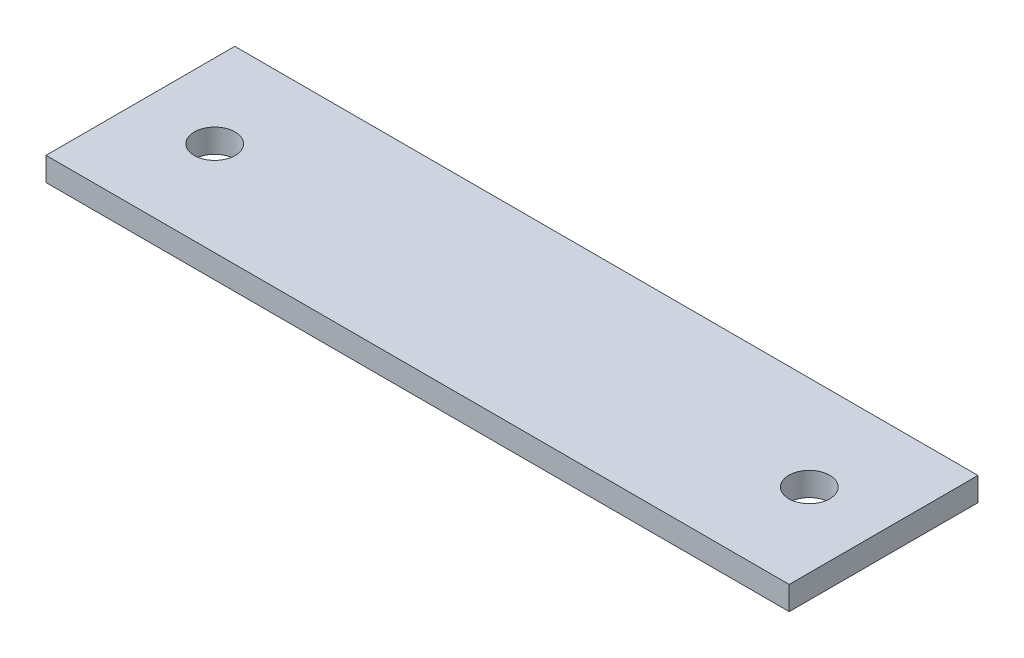
ISO-10303-21;
HEADER;
FILE_DESCRIPTION(('STEP AP214'),'2;1');
FILE_NAME('part.step','',(''),(''),'','','');
FILE_SCHEMA(('AUTOMOTIVE_DESIGN { 1 0 10303 214 1 1 1 1 }'));
ENDSEC;
DATA;
#1=APPLICATION_CONTEXT('core data for automotive mechanical design processes');
#2=APPLICATION_PROTOCOL_DEFINITION('international standard','automotive_design',2000,#1);
#3=PRODUCT_CONTEXT('',#1,'mechanical');
#4=PRODUCT('Part','Part','',(#3));
#5=PRODUCT_RELATED_PRODUCT_CATEGORY('part','',(#4));
#6=PRODUCT_DEFINITION_FORMATION('','',#4);
#7=PRODUCT_DEFINITION_CONTEXT('part definition',#1,'design');
#8=PRODUCT_DEFINITION('design','',#6,#7);
#9=PRODUCT_DEFINITION_SHAPE('','',#8);
#10=(LENGTH_UNIT() NAMED_UNIT(*) SI_UNIT(.MILLI.,.METRE.));
#11=(NAMED_UNIT(*) PLANE_ANGLE_UNIT() SI_UNIT($,.RADIAN.));
#12=(NAMED_UNIT(*) SI_UNIT($,.STERADIAN.) SOLID_ANGLE_UNIT());
#13=UNCERTAINTY_MEASURE_WITH_UNIT(LENGTH_MEASURE(1.E-05),#10,'distance_accuracy_value','');
#14=(GEOMETRIC_REPRESENTATION_CONTEXT(3) GLOBAL_UNCERTAINTY_ASSIGNED_CONTEXT((#13)) GLOBAL_UNIT_ASSIGNED_CONTEXT((#10,
#11,#12)) REPRESENTATION_CONTEXT('',''));
#15=CARTESIAN_POINT('',(0.,0.,0.));
#16=DIRECTION('',(0.,0.,1.));
#17=DIRECTION('',(1.,0.,0.));
#18=AXIS2_PLACEMENT_3D('',#15,#16,#17);
#19=CARTESIAN_POINT('',(0.,3.175,0.));
#20=DIRECTION('',(1.,0.,0.));
#21=DIRECTION('',(0.,0.,-1.));
#22=AXIS2_PLACEMENT_3D('',#19,#20,#21);
#23=PLANE('',#22);
#24=DIRECTION('',(0.,0.,1.));
#25=VECTOR('',#24,1.);
#26=CARTESIAN_POINT('',(0.,0.,0.));
#27=LINE('',#26,#25);
#28=CARTESIAN_POINT('',(0.,0.,-25.4));
#29=VERTEX_POINT('',#28);
#30=CARTESIAN_POINT('',(0.,0.,0.));
#31=VERTEX_POINT('',#30);
#32=EDGE_CURVE('E109',#29,#31,#27,.T.);
#33=ORIENTED_EDGE('',*,*,#32,.T.);
#34=DIRECTION('',(0.,-1.,0.));
#35=VECTOR('',#34,1.);
#36=CARTESIAN_POINT('',(0.,3.175,0.));
#37=LINE('',#36,#35);
#38=CARTESIAN_POINT('',(0.,3.175,0.));
#39=VERTEX_POINT('',#38);
#40=EDGE_CURVE('E11',#39,#31,#37,.T.);
#41=ORIENTED_EDGE('',*,*,#40,.F.);
#42=DIRECTION('',(0.,0.,1.));
#43=VECTOR('',#42,1.);
#44=CARTESIAN_POINT('',(0.,3.175,0.));
#45=LINE('',#44,#43);
#46=CARTESIAN_POINT('',(0.,3.175,-25.4));
#47=VERTEX_POINT('',#46);
#48=EDGE_CURVE('E92',#47,#39,#45,.T.);
#49=ORIENTED_EDGE('',*,*,#48,.F.);
#50=DIRECTION('',(0.,-1.,0.));
#51=VECTOR('',#50,1.);
#52=CARTESIAN_POINT('',(0.,3.175,-25.4));
#53=LINE('',#52,#51);
#54=EDGE_CURVE('E105',#47,#29,#53,.T.);
#55=ORIENTED_EDGE('',*,*,#54,.T.);
#56=EDGE_LOOP('',(#33,#41,#49,#55));
#57=FACE_BOUND('',#56,.T.);
#58=ADVANCED_FACE('F39',(#57),#23,.F.);
#59=CARTESIAN_POINT('',(0.,3.175,0.));
#60=DIRECTION('',(0.,0.,-1.));
#61=DIRECTION('',(-1.,0.,0.));
#62=AXIS2_PLACEMENT_3D('',#59,#60,#61);
#63=PLANE('',#62);
#64=DIRECTION('',(1.,0.,0.));
#65=VECTOR('',#64,1.);
#66=CARTESIAN_POINT('',(0.,0.,0.));
#67=LINE('',#66,#65);
#68=CARTESIAN_POINT('',(100.,0.,0.));
#69=VERTEX_POINT('',#68);
#70=EDGE_CURVE('E97',#31,#69,#67,.T.);
#71=ORIENTED_EDGE('',*,*,#70,.T.);
#72=DIRECTION('',(0.,-1.,0.));
#73=VECTOR('',#72,1.);
#74=CARTESIAN_POINT('',(100.,3.175,0.));
#75=LINE('',#74,#73);
#76=CARTESIAN_POINT('',(100.,3.175,0.));
#77=VERTEX_POINT('',#76);
#78=EDGE_CURVE('E49',#77,#69,#75,.T.);
#79=ORIENTED_EDGE('',*,*,#78,.F.);
#80=DIRECTION('',(1.,0.,0.));
#81=VECTOR('',#80,1.);
#82=CARTESIAN_POINT('',(0.,3.175,0.));
#83=LINE('',#82,#81);
#84=EDGE_CURVE('E87',#39,#77,#83,.T.);
#85=ORIENTED_EDGE('',*,*,#84,.F.);
#86=ORIENTED_EDGE('',*,*,#40,.T.);
#87=EDGE_LOOP('',(#71,#79,#85,#86));
#88=FACE_BOUND('',#87,.T.);
#89=ADVANCED_FACE('F96',(#88),#63,.F.);
#90=CARTESIAN_POINT('',(100.,3.175,0.));
#91=DIRECTION('',(-1.,0.,0.));
#92=DIRECTION('',(0.,0.,1.));
#93=AXIS2_PLACEMENT_3D('',#90,#91,#92);
#94=PLANE('',#93);
#95=DIRECTION('',(0.,0.,-1.));
#96=VECTOR('',#95,1.);
#97=CARTESIAN_POINT('',(100.,0.,0.));
#98=LINE('',#97,#96);
#99=CARTESIAN_POINT('',(100.,0.,-25.4));
#100=VERTEX_POINT('',#99);
#101=EDGE_CURVE('E74',#69,#100,#98,.T.);
#102=ORIENTED_EDGE('',*,*,#101,.T.);
#103=DIRECTION('',(0.,-1.,0.));
#104=VECTOR('',#103,1.);
#105=CARTESIAN_POINT('',(100.,3.175,-25.4));
#106=LINE('',#105,#104);
#107=CARTESIAN_POINT('',(100.,3.175,-25.4));
#108=VERTEX_POINT('',#107);
#109=EDGE_CURVE('E99',#108,#100,#106,.T.);
#110=ORIENTED_EDGE('',*,*,#109,.F.);
#111=DIRECTION('',(0.,0.,-1.));
#112=VECTOR('',#111,1.);
#113=CARTESIAN_POINT('',(100.,3.175,0.));
#114=LINE('',#113,#112);
#115=EDGE_CURVE('E90',#77,#108,#114,.T.);
#116=ORIENTED_EDGE('',*,*,#115,.F.);
#117=ORIENTED_EDGE('',*,*,#78,.T.);
#118=EDGE_LOOP('',(#102,#110,#116,#117));
#119=FACE_BOUND('',#118,.T.);
#120=ADVANCED_FACE('F101',(#119),#94,.F.);
#121=CARTESIAN_POINT('',(0.,3.175,-25.4));
#122=DIRECTION('',(0.,0.,1.));
#123=DIRECTION('',(1.,0.,0.));
#124=AXIS2_PLACEMENT_3D('',#121,#122,#123);
#125=PLANE('',#124);
#126=DIRECTION('',(-1.,0.,0.));
#127=VECTOR('',#126,1.);
#128=CARTESIAN_POINT('',(0.,0.,-25.4));
#129=LINE('',#128,#127);
#130=EDGE_CURVE('E80',#100,#29,#129,.T.);
#131=ORIENTED_EDGE('',*,*,#130,.T.);
#132=ORIENTED_EDGE('',*,*,#54,.F.);
#133=DIRECTION('',(-1.,0.,0.));
#134=VECTOR('',#133,1.);
#135=CARTESIAN_POINT('',(0.,3.175,-25.4));
#136=LINE('',#135,#134);
#137=EDGE_CURVE('E57',#108,#47,#136,.T.);
#138=ORIENTED_EDGE('',*,*,#137,.F.);
#139=ORIENTED_EDGE('',*,*,#109,.T.);
#140=EDGE_LOOP('',(#131,#132,#138,#139));
#141=FACE_BOUND('',#140,.T.);
#142=ADVANCED_FACE('F123',(#141),#125,.F.);
#143=CARTESIAN_POINT('',(0.,3.175,0.));
#144=DIRECTION('',(0.,-1.,0.));
#145=DIRECTION('',(0.,0.,-1.));
#146=AXIS2_PLACEMENT_3D('',#143,#144,#145);
#147=PLANE('',#146);
#148=CARTESIAN_POINT('',(9.99999999999999,3.175,-12.7));
#149=DIRECTION('',(0.,1.,0.));
#150=DIRECTION('',(0.,0.,1.));
#151=AXIS2_PLACEMENT_3D('',#148,#149,#150);
#152=CIRCLE('',#151,2.75);
#153=CARTESIAN_POINT('',(9.99999999999999,3.175,-9.95));
#154=VERTEX_POINT('',#153);
#155=EDGE_CURVE('E137',#154,#154,#152,.T.);
#156=ORIENTED_EDGE('',*,*,#155,.F.);
#157=EDGE_LOOP('',(#156));
#158=FACE_BOUND('',#157,.T.);
#159=CARTESIAN_POINT('',(90.,3.175,-12.7));
#160=DIRECTION('',(0.,1.,0.));
#161=DIRECTION('',(0.,0.,1.));
#162=AXIS2_PLACEMENT_3D('',#159,#160,#161);
#163=CIRCLE('',#162,2.75);
#164=CARTESIAN_POINT('',(90.,3.175,-9.95));
#165=VERTEX_POINT('',#164);
#166=EDGE_CURVE('E133',#165,#165,#163,.T.);
#167=ORIENTED_EDGE('',*,*,#166,.F.);
#168=EDGE_LOOP('',(#167));
#169=FACE_BOUND('',#168,.T.);
#170=ORIENTED_EDGE('',*,*,#48,.T.);
#171=ORIENTED_EDGE('',*,*,#84,.T.);
#172=ORIENTED_EDGE('',*,*,#115,.T.);
#173=ORIENTED_EDGE('',*,*,#137,.T.);
#174=EDGE_LOOP('',(#170,#171,#172,#173));
#175=FACE_BOUND('',#174,.T.);
#176=ADVANCED_FACE('F88',(#158,#169,#175),#147,.F.);
#177=CARTESIAN_POINT('',(0.,0.,0.));
#178=DIRECTION('',(0.,-1.,0.));
#179=DIRECTION('',(0.,0.,-1.));
#180=AXIS2_PLACEMENT_3D('',#177,#178,#179);
#181=PLANE('',#180);
#182=CARTESIAN_POINT('',(9.99999999999999,0.,-12.7));
#183=DIRECTION('',(0.,-1.,0.));
#184=DIRECTION('',(0.,0.,-1.));
#185=AXIS2_PLACEMENT_3D('',#182,#183,#184);
#186=CIRCLE('',#185,2.75);
#187=CARTESIAN_POINT('',(9.99999999999999,0.,-15.45));
#188=VERTEX_POINT('',#187);
#189=EDGE_CURVE('E42',#188,#188,#186,.T.);
#190=ORIENTED_EDGE('',*,*,#189,.F.);
#191=EDGE_LOOP('',(#190));
#192=FACE_BOUND('',#191,.T.);
#193=CARTESIAN_POINT('',(90.,0.,-12.7));
#194=DIRECTION('',(0.,-1.,0.));
#195=DIRECTION('',(0.,0.,-1.));
#196=AXIS2_PLACEMENT_3D('',#193,#194,#195);
#197=CIRCLE('',#196,2.75);
#198=CARTESIAN_POINT('',(90.,0.,-15.45));
#199=VERTEX_POINT('',#198);
#200=EDGE_CURVE('E113',#199,#199,#197,.T.);
#201=ORIENTED_EDGE('',*,*,#200,.F.);
#202=EDGE_LOOP('',(#201));
#203=FACE_BOUND('',#202,.T.);
#204=ORIENTED_EDGE('',*,*,#32,.F.);
#205=ORIENTED_EDGE('',*,*,#130,.F.);
#206=ORIENTED_EDGE('',*,*,#101,.F.);
#207=ORIENTED_EDGE('',*,*,#70,.F.);
#208=EDGE_LOOP('',(#204,#205,#206,#207));
#209=FACE_BOUND('',#208,.T.);
#210=ADVANCED_FACE('F126',(#192,#203,#209),#181,.T.);
#211=CARTESIAN_POINT('',(90.,3.175,-12.7));
#212=DIRECTION('',(0.,1.,0.));
#213=DIRECTION('',(0.,0.,1.));
#214=AXIS2_PLACEMENT_3D('',#211,#212,#213);
#215=CYLINDRICAL_SURFACE('',#214,2.75);
#216=ORIENTED_EDGE('',*,*,#200,.T.);
#217=EDGE_LOOP('',(#216));
#218=FACE_BOUND('',#217,.T.);
#219=ORIENTED_EDGE('',*,*,#166,.T.);
#220=EDGE_LOOP('',(#219));
#221=FACE_BOUND('',#220,.T.);
#222=ADVANCED_FACE('F150',(#218,#221),#215,.F.);
#223=CARTESIAN_POINT('',(9.99999999999999,3.175,-12.7));
#224=DIRECTION('',(0.,1.,0.));
#225=DIRECTION('',(0.,0.,1.));
#226=AXIS2_PLACEMENT_3D('',#223,#224,#225);
#227=CYLINDRICAL_SURFACE('',#226,2.75);
#228=ORIENTED_EDGE('',*,*,#189,.T.);
#229=EDGE_LOOP('',(#228));
#230=FACE_BOUND('',#229,.T.);
#231=ORIENTED_EDGE('',*,*,#155,.T.);
#232=EDGE_LOOP('',(#231));
#233=FACE_BOUND('',#232,.T.);
#234=ADVANCED_FACE('F146',(#230,#233),#227,.F.);
#235=CLOSED_SHELL('',(#58,#89,#120,#142,#176,#210,#222,#234));
#236=MANIFOLD_SOLID_BREP('B2',#235);
#237=ADVANCED_BREP_SHAPE_REPRESENTATION('',(#18,#236),#14);
#238=SHAPE_DEFINITION_REPRESENTATION(#9,#237);
ENDSEC;
END-ISO-10303-21;
